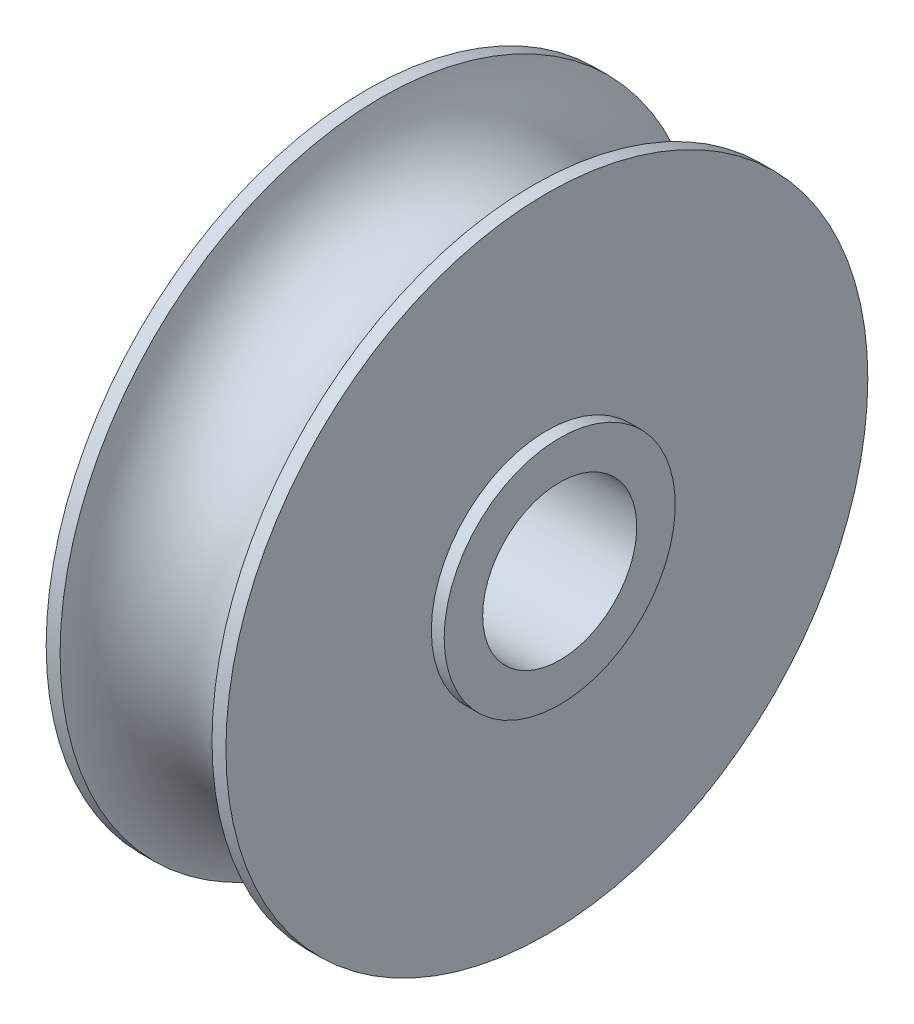
ISO-10303-21;
HEADER;
FILE_DESCRIPTION(('STEP AP214'),'2;1');
FILE_NAME('part.step','',(''),(''),'','','');
FILE_SCHEMA(('AUTOMOTIVE_DESIGN { 1 0 10303 214 1 1 1 1 }'));
ENDSEC;
DATA;
#1=APPLICATION_CONTEXT('core data for automotive mechanical design processes');
#2=APPLICATION_PROTOCOL_DEFINITION('international standard','automotive_design',2000,#1);
#3=PRODUCT_CONTEXT('',#1,'mechanical');
#4=PRODUCT('Part','Part','',(#3));
#5=PRODUCT_RELATED_PRODUCT_CATEGORY('part','',(#4));
#6=PRODUCT_DEFINITION_FORMATION('','',#4);
#7=PRODUCT_DEFINITION_CONTEXT('part definition',#1,'design');
#8=PRODUCT_DEFINITION('design','',#6,#7);
#9=PRODUCT_DEFINITION_SHAPE('','',#8);
#10=(LENGTH_UNIT() NAMED_UNIT(*) SI_UNIT(.MILLI.,.METRE.));
#11=(NAMED_UNIT(*) PLANE_ANGLE_UNIT() SI_UNIT($,.RADIAN.));
#12=(NAMED_UNIT(*) SI_UNIT($,.STERADIAN.) SOLID_ANGLE_UNIT());
#13=UNCERTAINTY_MEASURE_WITH_UNIT(LENGTH_MEASURE(1.E-05),#10,'distance_accuracy_value','');
#14=(GEOMETRIC_REPRESENTATION_CONTEXT(3) GLOBAL_UNCERTAINTY_ASSIGNED_CONTEXT((#13)) GLOBAL_UNIT_ASSIGNED_CONTEXT((#10,
#11,#12)) REPRESENTATION_CONTEXT('',''));
#15=CARTESIAN_POINT('',(0.,0.,0.));
#16=DIRECTION('',(0.,0.,1.));
#17=DIRECTION('',(1.,0.,0.));
#18=AXIS2_PLACEMENT_3D('',#15,#16,#17);
#19=CARTESIAN_POINT('',(-29.0798291721419,0.,0.));
#20=DIRECTION('',(-1.,0.,0.));
#21=DIRECTION('',(0.,0.,1.));
#22=AXIS2_PLACEMENT_3D('',#19,#20,#21);
#23=CYLINDRICAL_SURFACE('',#22,4.5);
#24=CARTESIAN_POINT('',(3.5,0.,0.));
#25=DIRECTION('',(-1.,0.,0.));
#26=DIRECTION('',(0.,0.,1.));
#27=AXIS2_PLACEMENT_3D('',#24,#25,#26);
#28=CIRCLE('',#27,4.5);
#29=CARTESIAN_POINT('',(3.5,0.,4.5));
#30=VERTEX_POINT('',#29);
#31=EDGE_CURVE('E10',#30,#30,#28,.T.);
#32=ORIENTED_EDGE('',*,*,#31,.F.);
#33=EDGE_LOOP('',(#32));
#34=FACE_BOUND('',#33,.T.);
#35=CARTESIAN_POINT('',(4.,0.,0.));
#36=DIRECTION('',(-1.,0.,0.));
#37=DIRECTION('',(0.,0.,1.));
#38=AXIS2_PLACEMENT_3D('',#35,#36,#37);
#39=CIRCLE('',#38,4.5);
#40=CARTESIAN_POINT('',(4.,0.,4.5));
#41=VERTEX_POINT('',#40);
#42=EDGE_CURVE('E65',#41,#41,#39,.T.);
#43=ORIENTED_EDGE('',*,*,#42,.T.);
#44=EDGE_LOOP('',(#43));
#45=FACE_BOUND('',#44,.T.);
#46=ADVANCED_FACE('F31',(#34,#45),#23,.T.);
#47=CARTESIAN_POINT('',(3.5,12.5,0.));
#48=DIRECTION('',(-1.,0.,0.));
#49=DIRECTION('',(0.,0.,1.));
#50=AXIS2_PLACEMENT_3D('',#47,#48,#49);
#51=PLANE('',#50);
#52=CARTESIAN_POINT('',(3.5,0.,0.));
#53=DIRECTION('',(-1.,0.,0.));
#54=DIRECTION('',(0.,0.,1.));
#55=AXIS2_PLACEMENT_3D('',#52,#53,#54);
#56=CIRCLE('',#55,12.5);
#57=CARTESIAN_POINT('',(3.5,0.,12.5));
#58=VERTEX_POINT('',#57);
#59=EDGE_CURVE('E37',#58,#58,#56,.T.);
#60=ORIENTED_EDGE('',*,*,#59,.F.);
#61=EDGE_LOOP('',(#60));
#62=FACE_BOUND('',#61,.T.);
#63=ORIENTED_EDGE('',*,*,#31,.T.);
#64=EDGE_LOOP('',(#63));
#65=FACE_BOUND('',#64,.T.);
#66=ADVANCED_FACE('F114',(#62,#65),#51,.F.);
#67=CARTESIAN_POINT('',(-29.0798291721419,0.,0.));
#68=DIRECTION('',(-1.,0.,0.));
#69=DIRECTION('',(0.,0.,1.));
#70=AXIS2_PLACEMENT_3D('',#67,#68,#69);
#71=CYLINDRICAL_SURFACE('',#70,12.5);
#72=CARTESIAN_POINT('',(2.95803989154981,0.,0.));
#73=DIRECTION('',(-1.,0.,0.));
#74=DIRECTION('',(0.,0.,1.));
#75=AXIS2_PLACEMENT_3D('',#72,#73,#74);
#76=CIRCLE('',#75,12.5);
#77=CARTESIAN_POINT('',(2.95803989154981,0.,12.5));
#78=VERTEX_POINT('',#77);
#79=EDGE_CURVE('E41',#78,#78,#76,.T.);
#80=ORIENTED_EDGE('',*,*,#79,.F.);
#81=EDGE_LOOP('',(#80));
#82=FACE_BOUND('',#81,.T.);
#83=ORIENTED_EDGE('',*,*,#59,.T.);
#84=EDGE_LOOP('',(#83));
#85=FACE_BOUND('',#84,.T.);
#86=ADVANCED_FACE('F109',(#82,#85),#71,.T.);
#87=CARTESIAN_POINT('',(0.,0.,0.));
#88=DIRECTION('',(-1.,0.,0.));
#89=DIRECTION('',(0.,0.,1.));
#90=AXIS2_PLACEMENT_3D('',#87,#88,#89);
#91=TOROIDAL_SURFACE('',#90,13.,3.);
#92=CARTESIAN_POINT('',(-2.95803989154981,0.,0.));
#93=DIRECTION('',(-1.,0.,0.));
#94=DIRECTION('',(0.,0.,1.));
#95=AXIS2_PLACEMENT_3D('',#92,#93,#94);
#96=CIRCLE('',#95,12.5);
#97=CARTESIAN_POINT('',(-2.95803989154981,0.,12.5));
#98=VERTEX_POINT('',#97);
#99=EDGE_CURVE('E45',#98,#98,#96,.T.);
#100=ORIENTED_EDGE('',*,*,#99,.F.);
#101=EDGE_LOOP('',(#100));
#102=FACE_BOUND('',#101,.T.);
#103=ORIENTED_EDGE('',*,*,#79,.T.);
#104=EDGE_LOOP('',(#103));
#105=FACE_BOUND('',#104,.T.);
#106=ADVANCED_FACE('F103',(#102,#105),#91,.F.);
#107=CARTESIAN_POINT('',(-29.0798291721419,0.,0.));
#108=DIRECTION('',(-1.,0.,0.));
#109=DIRECTION('',(0.,0.,1.));
#110=AXIS2_PLACEMENT_3D('',#107,#108,#109);
#111=CYLINDRICAL_SURFACE('',#110,12.5);
#112=CARTESIAN_POINT('',(-3.5,0.,0.));
#113=DIRECTION('',(-1.,0.,0.));
#114=DIRECTION('',(0.,0.,1.));
#115=AXIS2_PLACEMENT_3D('',#112,#113,#114);
#116=CIRCLE('',#115,12.5);
#117=CARTESIAN_POINT('',(-3.5,0.,12.5));
#118=VERTEX_POINT('',#117);
#119=EDGE_CURVE('E50',#118,#118,#116,.T.);
#120=ORIENTED_EDGE('',*,*,#119,.F.);
#121=EDGE_LOOP('',(#120));
#122=FACE_BOUND('',#121,.T.);
#123=ORIENTED_EDGE('',*,*,#99,.T.);
#124=EDGE_LOOP('',(#123));
#125=FACE_BOUND('',#124,.T.);
#126=ADVANCED_FACE('F97',(#122,#125),#111,.T.);
#127=CARTESIAN_POINT('',(-3.5,12.5,0.));
#128=DIRECTION('',(1.,0.,0.));
#129=DIRECTION('',(0.,0.,-1.));
#130=AXIS2_PLACEMENT_3D('',#127,#128,#129);
#131=PLANE('',#130);
#132=CARTESIAN_POINT('',(-3.5,0.,0.));
#133=DIRECTION('',(-1.,0.,0.));
#134=DIRECTION('',(0.,0.,1.));
#135=AXIS2_PLACEMENT_3D('',#132,#133,#134);
#136=CIRCLE('',#135,4.5);
#137=CARTESIAN_POINT('',(-3.5,0.,4.5));
#138=VERTEX_POINT('',#137);
#139=EDGE_CURVE('E53',#138,#138,#136,.T.);
#140=ORIENTED_EDGE('',*,*,#139,.F.);
#141=EDGE_LOOP('',(#140));
#142=FACE_BOUND('',#141,.T.);
#143=ORIENTED_EDGE('',*,*,#119,.T.);
#144=EDGE_LOOP('',(#143));
#145=FACE_BOUND('',#144,.T.);
#146=ADVANCED_FACE('F91',(#142,#145),#131,.F.);
#147=CARTESIAN_POINT('',(-29.0798291721419,0.,0.));
#148=DIRECTION('',(-1.,0.,0.));
#149=DIRECTION('',(0.,0.,1.));
#150=AXIS2_PLACEMENT_3D('',#147,#148,#149);
#151=CYLINDRICAL_SURFACE('',#150,4.5);
#152=CARTESIAN_POINT('',(-4.,0.,0.));
#153=DIRECTION('',(-1.,0.,0.));
#154=DIRECTION('',(0.,0.,1.));
#155=AXIS2_PLACEMENT_3D('',#152,#153,#154);
#156=CIRCLE('',#155,4.5);
#157=CARTESIAN_POINT('',(-4.,0.,4.5));
#158=VERTEX_POINT('',#157);
#159=EDGE_CURVE('E56',#158,#158,#156,.T.);
#160=ORIENTED_EDGE('',*,*,#159,.F.);
#161=EDGE_LOOP('',(#160));
#162=FACE_BOUND('',#161,.T.);
#163=ORIENTED_EDGE('',*,*,#139,.T.);
#164=EDGE_LOOP('',(#163));
#165=FACE_BOUND('',#164,.T.);
#166=ADVANCED_FACE('F85',(#162,#165),#151,.T.);
#167=CARTESIAN_POINT('',(-4.,4.5,0.));
#168=DIRECTION('',(1.,0.,0.));
#169=DIRECTION('',(0.,0.,-1.));
#170=AXIS2_PLACEMENT_3D('',#167,#168,#169);
#171=PLANE('',#170);
#172=CARTESIAN_POINT('',(-4.,0.,0.));
#173=DIRECTION('',(-1.,0.,0.));
#174=DIRECTION('',(0.,0.,1.));
#175=AXIS2_PLACEMENT_3D('',#172,#173,#174);
#176=CIRCLE('',#175,3.);
#177=CARTESIAN_POINT('',(-4.,0.,3.));
#178=VERTEX_POINT('',#177);
#179=EDGE_CURVE('E59',#178,#178,#176,.T.);
#180=ORIENTED_EDGE('',*,*,#179,.F.);
#181=EDGE_LOOP('',(#180));
#182=FACE_BOUND('',#181,.T.);
#183=ORIENTED_EDGE('',*,*,#159,.T.);
#184=EDGE_LOOP('',(#183));
#185=FACE_BOUND('',#184,.T.);
#186=ADVANCED_FACE('F79',(#182,#185),#171,.F.);
#187=CARTESIAN_POINT('',(-29.0798291721419,0.,0.));
#188=DIRECTION('',(-1.,0.,0.));
#189=DIRECTION('',(0.,0.,1.));
#190=AXIS2_PLACEMENT_3D('',#187,#188,#189);
#191=CYLINDRICAL_SURFACE('',#190,3.);
#192=CARTESIAN_POINT('',(4.,0.,0.));
#193=DIRECTION('',(-1.,0.,0.));
#194=DIRECTION('',(0.,0.,1.));
#195=AXIS2_PLACEMENT_3D('',#192,#193,#194);
#196=CIRCLE('',#195,3.);
#197=CARTESIAN_POINT('',(4.,0.,3.));
#198=VERTEX_POINT('',#197);
#199=EDGE_CURVE('E62',#198,#198,#196,.T.);
#200=ORIENTED_EDGE('',*,*,#199,.F.);
#201=EDGE_LOOP('',(#200));
#202=FACE_BOUND('',#201,.T.);
#203=ORIENTED_EDGE('',*,*,#179,.T.);
#204=EDGE_LOOP('',(#203));
#205=FACE_BOUND('',#204,.T.);
#206=ADVANCED_FACE('F73',(#202,#205),#191,.F.);
#207=CARTESIAN_POINT('',(4.,4.5,0.));
#208=DIRECTION('',(-1.,0.,0.));
#209=DIRECTION('',(0.,0.,1.));
#210=AXIS2_PLACEMENT_3D('',#207,#208,#209);
#211=PLANE('',#210);
#212=ORIENTED_EDGE('',*,*,#42,.F.);
#213=EDGE_LOOP('',(#212));
#214=FACE_BOUND('',#213,.T.);
#215=ORIENTED_EDGE('',*,*,#199,.T.);
#216=EDGE_LOOP('',(#215));
#217=FACE_BOUND('',#216,.T.);
#218=ADVANCED_FACE('F70',(#214,#217),#211,.F.);
#219=CLOSED_SHELL('',(#46,#66,#86,#106,#126,#146,#166,#186,#206,#218));
#220=MANIFOLD_SOLID_BREP('B2',#219);
#221=ADVANCED_BREP_SHAPE_REPRESENTATION('',(#18,#220),#14);
#222=SHAPE_DEFINITION_REPRESENTATION(#9,#221);
ENDSEC;
END-ISO-10303-21;
